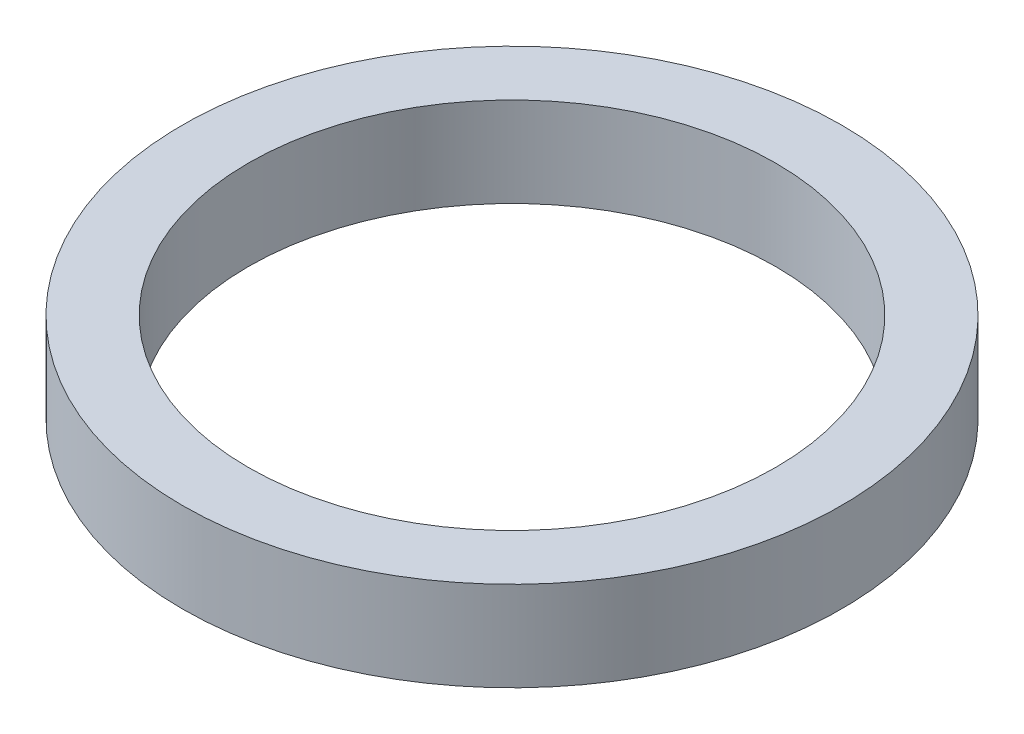
ISO-10303-21;
HEADER;
FILE_DESCRIPTION(('STEP AP214'),'2;1');
FILE_NAME('part.step','',(''),(''),'','','');
FILE_SCHEMA(('AUTOMOTIVE_DESIGN { 1 0 10303 214 1 1 1 1 }'));
ENDSEC;
DATA;
#1=APPLICATION_CONTEXT('core data for automotive mechanical design processes');
#2=APPLICATION_PROTOCOL_DEFINITION('international standard','automotive_design',2000,#1);
#3=PRODUCT_CONTEXT('',#1,'mechanical');
#4=PRODUCT('Part','Part','',(#3));
#5=PRODUCT_RELATED_PRODUCT_CATEGORY('part','',(#4));
#6=PRODUCT_DEFINITION_FORMATION('','',#4);
#7=PRODUCT_DEFINITION_CONTEXT('part definition',#1,'design');
#8=PRODUCT_DEFINITION('design','',#6,#7);
#9=PRODUCT_DEFINITION_SHAPE('','',#8);
#10=(LENGTH_UNIT() NAMED_UNIT(*) SI_UNIT(.MILLI.,.METRE.));
#11=(NAMED_UNIT(*) PLANE_ANGLE_UNIT() SI_UNIT($,.RADIAN.));
#12=(NAMED_UNIT(*) SI_UNIT($,.STERADIAN.) SOLID_ANGLE_UNIT());
#13=UNCERTAINTY_MEASURE_WITH_UNIT(LENGTH_MEASURE(1.E-05),#10,'distance_accuracy_value','');
#14=(GEOMETRIC_REPRESENTATION_CONTEXT(3) GLOBAL_UNCERTAINTY_ASSIGNED_CONTEXT((#13)) GLOBAL_UNIT_ASSIGNED_CONTEXT((#10,
#11,#12)) REPRESENTATION_CONTEXT('',''));
#15=CARTESIAN_POINT('',(0.,0.,0.));
#16=DIRECTION('',(0.,0.,1.));
#17=DIRECTION('',(1.,0.,0.));
#18=AXIS2_PLACEMENT_3D('',#15,#16,#17);
#19=CARTESIAN_POINT('',(0.,17.,0.));
#20=DIRECTION('',(0.,-1.,0.));
#21=DIRECTION('',(0.,0.,-1.));
#22=AXIS2_PLACEMENT_3D('',#19,#20,#21);
#23=CYLINDRICAL_SURFACE('',#22,62.5);
#24=CARTESIAN_POINT('',(0.,17.,0.));
#25=DIRECTION('',(0.,1.,0.));
#26=DIRECTION('',(0.,0.,1.));
#27=AXIS2_PLACEMENT_3D('',#24,#25,#26);
#28=CIRCLE('',#27,62.5);
#29=CARTESIAN_POINT('',(0.,17.,62.5));
#30=VERTEX_POINT('',#29);
#31=EDGE_CURVE('E10',#30,#30,#28,.T.);
#32=ORIENTED_EDGE('',*,*,#31,.F.);
#33=EDGE_LOOP('',(#32));
#34=FACE_BOUND('',#33,.T.);
#35=CARTESIAN_POINT('',(0.,0.,0.));
#36=DIRECTION('',(0.,1.,0.));
#37=DIRECTION('',(0.,0.,1.));
#38=AXIS2_PLACEMENT_3D('',#35,#36,#37);
#39=CIRCLE('',#38,62.5);
#40=CARTESIAN_POINT('',(0.,0.,62.5));
#41=VERTEX_POINT('',#40);
#42=EDGE_CURVE('E37',#41,#41,#39,.T.);
#43=ORIENTED_EDGE('',*,*,#42,.T.);
#44=EDGE_LOOP('',(#43));
#45=FACE_BOUND('',#44,.T.);
#46=ADVANCED_FACE('F40',(#34,#45),#23,.T.);
#47=CARTESIAN_POINT('',(0.,17.,0.));
#48=DIRECTION('',(0.,1.,0.));
#49=DIRECTION('',(0.,0.,1.));
#50=AXIS2_PLACEMENT_3D('',#47,#48,#49);
#51=PLANE('',#50);
#52=CARTESIAN_POINT('',(0.,17.,0.));
#53=DIRECTION('',(0.,1.,0.));
#54=DIRECTION('',(0.,0.,1.));
#55=AXIS2_PLACEMENT_3D('',#52,#53,#54);
#56=CIRCLE('',#55,50.);
#57=CARTESIAN_POINT('',(0.,17.,50.));
#58=VERTEX_POINT('',#57);
#59=EDGE_CURVE('E50',#58,#58,#56,.T.);
#60=ORIENTED_EDGE('',*,*,#59,.F.);
#61=EDGE_LOOP('',(#60));
#62=FACE_BOUND('',#61,.T.);
#63=ORIENTED_EDGE('',*,*,#31,.T.);
#64=EDGE_LOOP('',(#63));
#65=FACE_BOUND('',#64,.T.);
#66=ADVANCED_FACE('F59',(#62,#65),#51,.T.);
#67=CARTESIAN_POINT('',(0.,0.,0.));
#68=DIRECTION('',(0.,1.,0.));
#69=DIRECTION('',(0.,0.,1.));
#70=AXIS2_PLACEMENT_3D('',#67,#68,#69);
#71=PLANE('',#70);
#72=CARTESIAN_POINT('',(0.,0.,0.));
#73=DIRECTION('',(0.,1.,0.));
#74=DIRECTION('',(0.,0.,1.));
#75=AXIS2_PLACEMENT_3D('',#72,#73,#74);
#76=CIRCLE('',#75,50.);
#77=CARTESIAN_POINT('',(0.,0.,50.));
#78=VERTEX_POINT('',#77);
#79=EDGE_CURVE('E47',#78,#78,#76,.T.);
#80=ORIENTED_EDGE('',*,*,#79,.T.);
#81=EDGE_LOOP('',(#80));
#82=FACE_BOUND('',#81,.T.);
#83=ORIENTED_EDGE('',*,*,#42,.F.);
#84=EDGE_LOOP('',(#83));
#85=FACE_BOUND('',#84,.T.);
#86=ADVANCED_FACE('F58',(#82,#85),#71,.F.);
#87=CARTESIAN_POINT('',(0.,17.,0.));
#88=DIRECTION('',(0.,-1.,0.));
#89=DIRECTION('',(0.,0.,-1.));
#90=AXIS2_PLACEMENT_3D('',#87,#88,#89);
#91=CYLINDRICAL_SURFACE('',#90,50.);
#92=ORIENTED_EDGE('',*,*,#59,.T.);
#93=EDGE_LOOP('',(#92));
#94=FACE_BOUND('',#93,.T.);
#95=ORIENTED_EDGE('',*,*,#79,.F.);
#96=EDGE_LOOP('',(#95));
#97=FACE_BOUND('',#96,.T.);
#98=ADVANCED_FACE('F54',(#94,#97),#91,.F.);
#99=CLOSED_SHELL('',(#46,#66,#86,#98));
#100=MANIFOLD_SOLID_BREP('B2',#99);
#101=ADVANCED_BREP_SHAPE_REPRESENTATION('',(#18,#100),#14);
#102=SHAPE_DEFINITION_REPRESENTATION(#9,#101);
ENDSEC;
END-ISO-10303-21;
